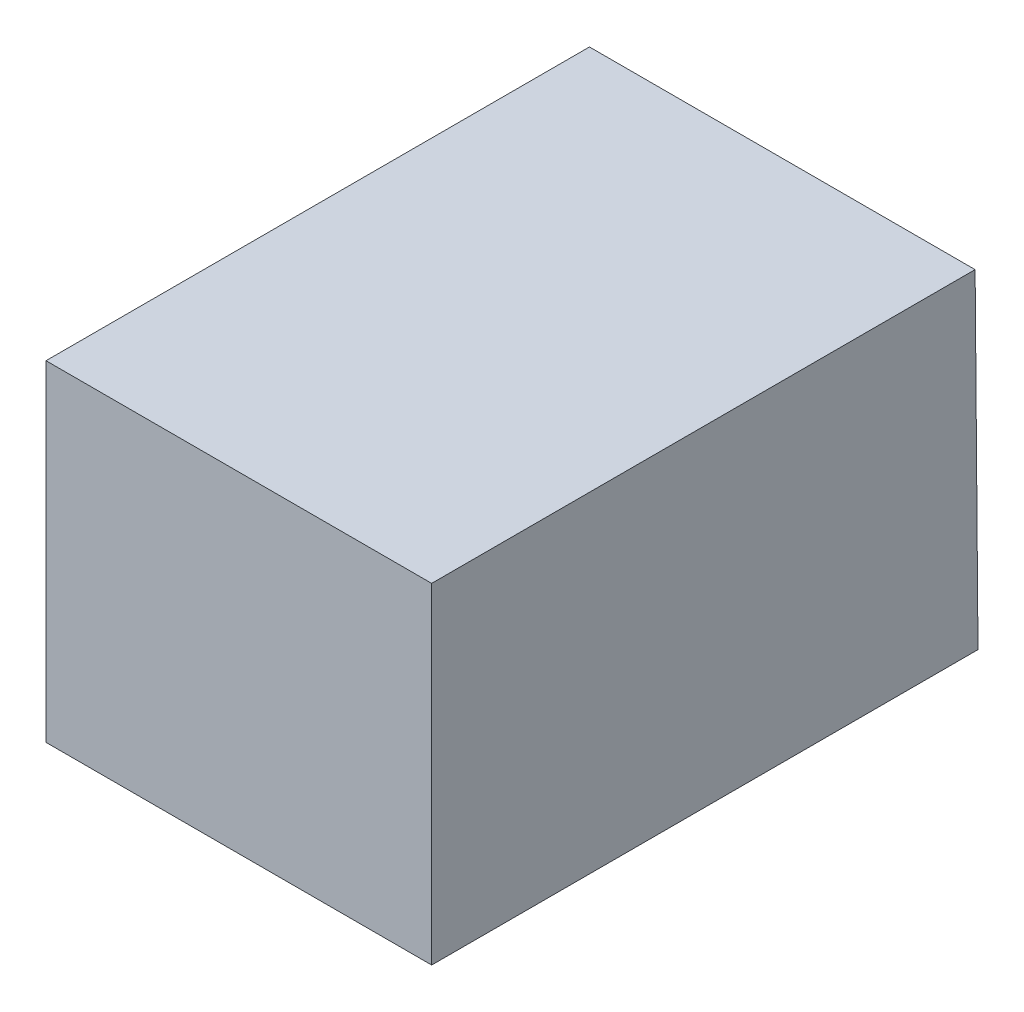
ISO-10303-21;
HEADER;
FILE_DESCRIPTION(('STEP AP214'),'2;1');
FILE_NAME('part.step','',(''),(''),'','','');
FILE_SCHEMA(('AUTOMOTIVE_DESIGN { 1 0 10303 214 1 1 1 1 }'));
ENDSEC;
DATA;
#1=APPLICATION_CONTEXT('core data for automotive mechanical design processes');
#2=APPLICATION_PROTOCOL_DEFINITION('international standard','automotive_design',2000,#1);
#3=PRODUCT_CONTEXT('',#1,'mechanical');
#4=PRODUCT('Part','Part','',(#3));
#5=PRODUCT_RELATED_PRODUCT_CATEGORY('part','',(#4));
#6=PRODUCT_DEFINITION_FORMATION('','',#4);
#7=PRODUCT_DEFINITION_CONTEXT('part definition',#1,'design');
#8=PRODUCT_DEFINITION('design','',#6,#7);
#9=PRODUCT_DEFINITION_SHAPE('','',#8);
#10=(LENGTH_UNIT() NAMED_UNIT(*) SI_UNIT(.MILLI.,.METRE.));
#11=(NAMED_UNIT(*) PLANE_ANGLE_UNIT() SI_UNIT($,.RADIAN.));
#12=(NAMED_UNIT(*) SI_UNIT($,.STERADIAN.) SOLID_ANGLE_UNIT());
#13=UNCERTAINTY_MEASURE_WITH_UNIT(LENGTH_MEASURE(1.E-05),#10,'distance_accuracy_value','');
#14=(GEOMETRIC_REPRESENTATION_CONTEXT(3) GLOBAL_UNCERTAINTY_ASSIGNED_CONTEXT((#13)) GLOBAL_UNIT_ASSIGNED_CONTEXT((#10,
#11,#12)) REPRESENTATION_CONTEXT('',''));
#15=CARTESIAN_POINT('',(0.,0.,0.));
#16=DIRECTION('',(0.,0.,1.));
#17=DIRECTION('',(1.,0.,0.));
#18=AXIS2_PLACEMENT_3D('',#15,#16,#17);
#19=CARTESIAN_POINT('',(68.0486610540912,48.001789615984,110.418905271699));
#20=DIRECTION('',(0.,-1.,0.));
#21=DIRECTION('',(0.,0.,-1.));
#22=AXIS2_PLACEMENT_3D('',#19,#20,#21);
#23=PLANE('',#22);
#24=DIRECTION('',(1.,0.,0.));
#25=VECTOR('',#24,1.);
#26=CARTESIAN_POINT('',(190.,48.001789615984,160.));
#27=LINE('',#26,#25);
#28=CARTESIAN_POINT('',(68.0486610540912,48.001789615984,160.));
#29=VERTEX_POINT('',#28);
#30=CARTESIAN_POINT('',(103.048661054091,48.001789615984,160.));
#31=VERTEX_POINT('',#30);
#32=EDGE_CURVE('E97',#29,#31,#27,.T.);
#33=ORIENTED_EDGE('',*,*,#32,.F.);
#34=DIRECTION('',(0.,0.,1.));
#35=VECTOR('',#34,1.);
#36=CARTESIAN_POINT('',(68.0486610540912,48.001789615984,110.418905271699));
#37=LINE('',#36,#35);
#38=CARTESIAN_POINT('',(68.0486610540912,48.001789615984,110.418905271698));
#39=VERTEX_POINT('',#38);
#40=EDGE_CURVE('E11',#39,#29,#37,.T.);
#41=ORIENTED_EDGE('',*,*,#40,.F.);
#42=DIRECTION('',(1.,0.,0.));
#43=VECTOR('',#42,1.);
#44=CARTESIAN_POINT('',(-135.,48.001789615984,110.418905271698));
#45=LINE('',#44,#43);
#46=CARTESIAN_POINT('',(103.048661054091,48.001789615984,110.418905271698));
#47=VERTEX_POINT('',#46);
#48=EDGE_CURVE('E107',#47,#39,#45,.F.);
#49=ORIENTED_EDGE('',*,*,#48,.F.);
#50=DIRECTION('',(0.,0.,1.));
#51=VECTOR('',#50,1.);
#52=CARTESIAN_POINT('',(103.048661054091,48.001789615984,110.418905271699));
#53=LINE('',#52,#51);
#54=EDGE_CURVE('E48',#47,#31,#53,.T.);
#55=ORIENTED_EDGE('',*,*,#54,.T.);
#56=EDGE_LOOP('',(#33,#41,#49,#55));
#57=FACE_BOUND('',#56,.T.);
#58=ADVANCED_FACE('F39',(#57),#23,.T.);
#59=CARTESIAN_POINT('',(68.0486610540912,78.0006473079091,110.68070133665));
#60=DIRECTION('',(-1.,0.,0.));
#61=DIRECTION('',(0.,0.,1.));
#62=AXIS2_PLACEMENT_3D('',#59,#60,#61);
#63=PLANE('',#62);
#64=DIRECTION('',(0.,-1.,0.));
#65=VECTOR('',#64,1.);
#66=CARTESIAN_POINT('',(68.0486610540912,125.,160.));
#67=LINE('',#66,#65);
#68=CARTESIAN_POINT('',(68.0486610540912,78.0006473079091,160.));
#69=VERTEX_POINT('',#68);
#70=EDGE_CURVE('E95',#69,#29,#67,.T.);
#71=ORIENTED_EDGE('',*,*,#70,.F.);
#72=DIRECTION('',(0.,0.,1.));
#73=VECTOR('',#72,1.);
#74=CARTESIAN_POINT('',(68.0486610540912,78.0006473079091,110.68070133665));
#75=LINE('',#74,#73);
#76=CARTESIAN_POINT('',(68.0486610540912,78.0006473079091,110.68070133665));
#77=VERTEX_POINT('',#76);
#78=EDGE_CURVE('E86',#77,#69,#75,.T.);
#79=ORIENTED_EDGE('',*,*,#78,.F.);
#80=DIRECTION('',(0.,-0.999961923064171,-0.00872653549837395));
#81=VECTOR('',#80,1.);
#82=CARTESIAN_POINT('',(68.0486610540912,0.,110.));
#83=LINE('',#82,#81);
#84=EDGE_CURVE('E104',#39,#77,#83,.F.);
#85=ORIENTED_EDGE('',*,*,#84,.F.);
#86=ORIENTED_EDGE('',*,*,#40,.T.);
#87=EDGE_LOOP('',(#71,#79,#85,#86));
#88=FACE_BOUND('',#87,.T.);
#89=ADVANCED_FACE('F134',(#88),#63,.T.);
#90=CARTESIAN_POINT('',(103.048661054091,78.0006473079091,110.68070133665));
#91=DIRECTION('',(1.,0.,0.));
#92=DIRECTION('',(0.,1.,0.));
#93=AXIS2_PLACEMENT_3D('',#90,#91,#92);
#94=PLANE('',#93);
#95=DIRECTION('',(0.,1.,0.));
#96=VECTOR('',#95,1.);
#97=CARTESIAN_POINT('',(103.048661054091,125.,160.));
#98=LINE('',#97,#96);
#99=CARTESIAN_POINT('',(103.048661054091,78.0006473079091,160.));
#100=VERTEX_POINT('',#99);
#101=EDGE_CURVE('E43',#31,#100,#98,.T.);
#102=ORIENTED_EDGE('',*,*,#101,.F.);
#103=ORIENTED_EDGE('',*,*,#54,.F.);
#104=DIRECTION('',(0.,0.999961923064171,0.00872653549837395));
#105=VECTOR('',#104,1.);
#106=CARTESIAN_POINT('',(103.048661054091,1.10115433850135E-13,110.));
#107=LINE('',#106,#105);
#108=CARTESIAN_POINT('',(103.048661054091,78.0006473079091,110.68070133665));
#109=VERTEX_POINT('',#108);
#110=EDGE_CURVE('E82',#109,#47,#107,.F.);
#111=ORIENTED_EDGE('',*,*,#110,.F.);
#112=DIRECTION('',(0.,0.,1.));
#113=VECTOR('',#112,1.);
#114=CARTESIAN_POINT('',(103.048661054091,78.0006473079091,110.68070133665));
#115=LINE('',#114,#113);
#116=EDGE_CURVE('E77',#109,#100,#115,.T.);
#117=ORIENTED_EDGE('',*,*,#116,.T.);
#118=EDGE_LOOP('',(#102,#103,#111,#117));
#119=FACE_BOUND('',#118,.T.);
#120=ADVANCED_FACE('F79',(#119),#94,.T.);
#121=CARTESIAN_POINT('',(68.0486610540912,78.0006473079091,110.68070133665));
#122=DIRECTION('',(0.,1.,0.));
#123=DIRECTION('',(0.,0.,1.));
#124=AXIS2_PLACEMENT_3D('',#121,#122,#123);
#125=PLANE('',#124);
#126=DIRECTION('',(-1.,0.,0.));
#127=VECTOR('',#126,1.);
#128=CARTESIAN_POINT('',(190.,78.0006473079091,160.));
#129=LINE('',#128,#127);
#130=EDGE_CURVE('E90',#100,#69,#129,.T.);
#131=ORIENTED_EDGE('',*,*,#130,.F.);
#132=ORIENTED_EDGE('',*,*,#116,.F.);
#133=DIRECTION('',(-1.,0.,0.));
#134=VECTOR('',#133,1.);
#135=CARTESIAN_POINT('',(-135.,78.0006473079091,110.68070133665));
#136=LINE('',#135,#134);
#137=EDGE_CURVE('E99',#77,#109,#136,.F.);
#138=ORIENTED_EDGE('',*,*,#137,.F.);
#139=ORIENTED_EDGE('',*,*,#78,.T.);
#140=EDGE_LOOP('',(#131,#132,#138,#139));
#141=FACE_BOUND('',#140,.T.);
#142=ADVANCED_FACE('F91',(#141),#125,.T.);
#143=CARTESIAN_POINT('',(0.,-0.938066015305024,107.491718425941));
#144=DIRECTION('',(0.,0.00872653549837735,-0.999961923064171));
#145=DIRECTION('',(0.,0.999961923064171,0.00872653549837735));
#146=AXIS2_PLACEMENT_3D('',#143,#144,#145);
#147=PLANE('',#146);
#148=CARTESIAN_POINT('',(85.5486610540912,63.0230348006925,108.049898496514));
#149=DIRECTION('',(0.,-0.00872653549837395,0.999961923064171));
#150=DIRECTION('',(0.,-0.999961923064171,-0.00872653549837395));
#151=AXIS2_PLACEMENT_3D('',#148,#149,#150);
#152=CIRCLE('',#151,4.00000000000001);
#153=CARTESIAN_POINT('',(85.5486610540912,59.0231871084358,108.01499235452));
#154=VERTEX_POINT('',#153);
#155=EDGE_CURVE('E108',#154,#154,#152,.F.);
#156=ORIENTED_EDGE('',*,*,#155,.T.);
#157=EDGE_LOOP('',(#156));
#158=FACE_BOUND('',#157,.T.);
#159=ADVANCED_FACE('F121',(#158),#147,.T.);
#160=CARTESIAN_POINT('',(85.5486610540912,63.2193818494059,85.5507552275698));
#161=DIRECTION('',(0.,-0.00872653549837395,0.999961923064171));
#162=DIRECTION('',(0.,-0.999961923064171,-0.00872653549837395));
#163=AXIS2_PLACEMENT_3D('',#160,#161,#162);
#164=CYLINDRICAL_SURFACE('',#163,4.00000000000001);
#165=ORIENTED_EDGE('',*,*,#155,.F.);
#166=EDGE_LOOP('',(#165));
#167=FACE_BOUND('',#166,.T.);
#168=CARTESIAN_POINT('',(85.5486610540912,63.0012184619465,110.549803304174));
#169=DIRECTION('',(0.,-0.00872653549837395,0.999961923064171));
#170=DIRECTION('',(0.,-0.999961923064171,-0.00872653549837395));
#171=AXIS2_PLACEMENT_3D('',#168,#169,#170);
#172=CIRCLE('',#171,4.00000000000001);
#173=CARTESIAN_POINT('',(85.5486610540912,59.0013707696898,110.514897162181));
#174=VERTEX_POINT('',#173);
#175=EDGE_CURVE('E87',#174,#174,#172,.T.);
#176=ORIENTED_EDGE('',*,*,#175,.F.);
#177=EDGE_LOOP('',(#176));
#178=FACE_BOUND('',#177,.T.);
#179=ADVANCED_FACE('F123',(#167,#178),#164,.T.);
#180=CARTESIAN_POINT('',(-135.,0.,110.));
#181=DIRECTION('',(0.,-0.00872653549837395,0.999961923064171));
#182=DIRECTION('',(0.,-0.999961923064171,-0.00872653549837395));
#183=AXIS2_PLACEMENT_3D('',#180,#181,#182);
#184=PLANE('',#183);
#185=ORIENTED_EDGE('',*,*,#175,.T.);
#186=EDGE_LOOP('',(#185));
#187=FACE_BOUND('',#186,.T.);
#188=ORIENTED_EDGE('',*,*,#137,.T.);
#189=ORIENTED_EDGE('',*,*,#110,.T.);
#190=ORIENTED_EDGE('',*,*,#48,.T.);
#191=ORIENTED_EDGE('',*,*,#84,.T.);
#192=EDGE_LOOP('',(#188,#189,#190,#191));
#193=FACE_BOUND('',#192,.T.);
#194=ADVANCED_FACE('F126',(#187,#193),#184,.F.);
#195=CARTESIAN_POINT('',(190.,125.,160.));
#196=DIRECTION('',(0.,0.,1.));
#197=DIRECTION('',(1.,0.,0.));
#198=AXIS2_PLACEMENT_3D('',#195,#196,#197);
#199=PLANE('',#198);
#200=ORIENTED_EDGE('',*,*,#32,.T.);
#201=ORIENTED_EDGE('',*,*,#101,.T.);
#202=ORIENTED_EDGE('',*,*,#130,.T.);
#203=ORIENTED_EDGE('',*,*,#70,.T.);
#204=EDGE_LOOP('',(#200,#201,#202,#203));
#205=FACE_BOUND('',#204,.T.);
#206=ADVANCED_FACE('F41',(#205),#199,.T.);
#207=CLOSED_SHELL('',(#58,#89,#120,#142,#159,#179,#194,#206));
#208=MANIFOLD_SOLID_BREP('B2',#207);
#209=ADVANCED_BREP_SHAPE_REPRESENTATION('',(#18,#208),#14);
#210=SHAPE_DEFINITION_REPRESENTATION(#9,#209);
ENDSEC;
END-ISO-10303-21;
